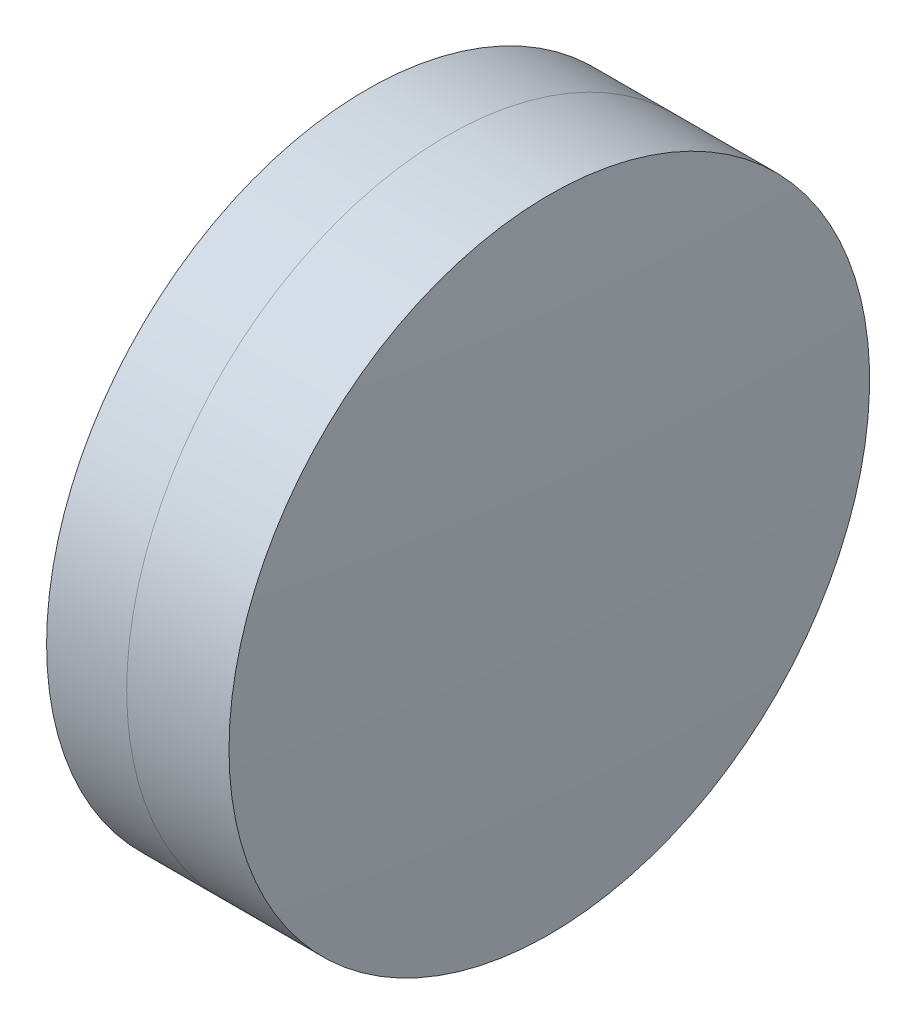
ISO-10303-21;
HEADER;
FILE_DESCRIPTION(('STEP AP214'),'2;1');
FILE_NAME('part.step','',(''),(''),'','','');
FILE_SCHEMA(('AUTOMOTIVE_DESIGN { 1 0 10303 214 1 1 1 1 }'));
ENDSEC;
DATA;
#1=APPLICATION_CONTEXT('core data for automotive mechanical design processes');
#2=APPLICATION_PROTOCOL_DEFINITION('international standard','automotive_design',2000,#1);
#3=PRODUCT_CONTEXT('',#1,'mechanical');
#4=PRODUCT('Part','Part','',(#3));
#5=PRODUCT_RELATED_PRODUCT_CATEGORY('part','',(#4));
#6=PRODUCT_DEFINITION_FORMATION('','',#4);
#7=PRODUCT_DEFINITION_CONTEXT('part definition',#1,'design');
#8=PRODUCT_DEFINITION('design','',#6,#7);
#9=PRODUCT_DEFINITION_SHAPE('','',#8);
#10=(LENGTH_UNIT() NAMED_UNIT(*) SI_UNIT(.MILLI.,.METRE.));
#11=(NAMED_UNIT(*) PLANE_ANGLE_UNIT() SI_UNIT($,.RADIAN.));
#12=(NAMED_UNIT(*) SI_UNIT($,.STERADIAN.) SOLID_ANGLE_UNIT());
#13=UNCERTAINTY_MEASURE_WITH_UNIT(LENGTH_MEASURE(1.E-05),#10,'distance_accuracy_value','');
#14=(GEOMETRIC_REPRESENTATION_CONTEXT(3) GLOBAL_UNCERTAINTY_ASSIGNED_CONTEXT((#13)) GLOBAL_UNIT_ASSIGNED_CONTEXT((#10,
#11,#12)) REPRESENTATION_CONTEXT('',''));
#15=CARTESIAN_POINT('',(0.,0.,0.));
#16=DIRECTION('',(0.,0.,1.));
#17=DIRECTION('',(1.,0.,0.));
#18=AXIS2_PLACEMENT_3D('',#15,#16,#17);
#19=CARTESIAN_POINT('',(-3.99472938404635,0.,0.));
#20=DIRECTION('',(-1.,0.,0.));
#21=DIRECTION('',(0.,0.,1.));
#22=AXIS2_PLACEMENT_3D('',#19,#20,#21);
#23=SPHERICAL_SURFACE('',#22,40.411);
#24=CARTESIAN_POINT('',(35.6164927758416,0.,0.));
#25=DIRECTION('',(-1.,0.,0.));
#26=DIRECTION('',(0.,0.,1.));
#27=AXIS2_PLACEMENT_3D('',#24,#25,#26);
#28=CIRCLE('',#27,8.00000000000001);
#29=CARTESIAN_POINT('',(35.6164927758416,0.,8.00000000000001));
#30=VERTEX_POINT('',#29);
#31=EDGE_CURVE('E11',#30,#30,#28,.T.);
#32=ORIENTED_EDGE('',*,*,#31,.T.);
#33=EDGE_LOOP('',(#32));
#34=FACE_BOUND('',#33,.T.);
#35=ADVANCED_FACE('F45',(#34),#23,.F.);
#36=CARTESIAN_POINT('',(-0.551919992657797,0.,0.));
#37=DIRECTION('',(-1.,0.,0.));
#38=DIRECTION('',(0.,0.,1.));
#39=AXIS2_PLACEMENT_3D('',#36,#37,#38);
#40=CYLINDRICAL_SURFACE('',#39,8.00000000000001);
#41=CARTESIAN_POINT('',(38.1709063103237,0.,0.));
#42=DIRECTION('',(-1.,0.,0.));
#43=DIRECTION('',(0.,0.,1.));
#44=AXIS2_PLACEMENT_3D('',#41,#42,#43);
#45=CIRCLE('',#44,8.00000000000001);
#46=CARTESIAN_POINT('',(38.1709063103237,0.,8.00000000000001));
#47=VERTEX_POINT('',#46);
#48=EDGE_CURVE('E51',#47,#47,#45,.T.);
#49=ORIENTED_EDGE('',*,*,#48,.T.);
#50=EDGE_LOOP('',(#49));
#51=FACE_BOUND('',#50,.T.);
#52=ORIENTED_EDGE('',*,*,#31,.F.);
#53=EDGE_LOOP('',(#52));
#54=FACE_BOUND('',#53,.T.);
#55=ADVANCED_FACE('F57',(#51,#54),#40,.T.);
#56=CARTESIAN_POINT('',(-92.1247293840463,0.,0.));
#57=DIRECTION('',(-1.,0.,0.));
#58=DIRECTION('',(0.,0.,1.));
#59=AXIS2_PLACEMENT_3D('',#56,#57,#58);
#60=SPHERICAL_SURFACE('',#59,130.541);
#61=ORIENTED_EDGE('',*,*,#48,.F.);
#62=EDGE_LOOP('',(#61));
#63=FACE_BOUND('',#62,.T.);
#64=ADVANCED_FACE('F60',(#63),#60,.T.);
#65=CLOSED_SHELL('',(#35,#55,#64));
#66=MANIFOLD_SOLID_BREP('B2',#65);
#67=CARTESIAN_POINT('',(95.0502706159536,0.,0.));
#68=DIRECTION('',(-1.,0.,0.));
#69=DIRECTION('',(0.,0.,-1.));
#70=AXIS2_PLACEMENT_3D('',#67,#68,#69);
#71=SPHERICAL_SURFACE('',#70,61.954);
#72=CARTESIAN_POINT('',(33.6149540952422,0.,0.));
#73=DIRECTION('',(-1.,0.,0.));
#74=DIRECTION('',(0.,0.,1.));
#75=AXIS2_PLACEMENT_3D('',#72,#73,#74);
#76=CIRCLE('',#75,8.);
#77=CARTESIAN_POINT('',(33.6149540952422,0.,8.));
#78=VERTEX_POINT('',#77);
#79=EDGE_CURVE('E44',#78,#78,#76,.T.);
#80=ORIENTED_EDGE('',*,*,#79,.T.);
#81=EDGE_LOOP('',(#80));
#82=FACE_BOUND('',#81,.T.);
#83=ADVANCED_FACE('F86',(#82),#71,.T.);
#84=CARTESIAN_POINT('',(-9.70261217833668,0.,0.));
#85=DIRECTION('',(-1.,0.,0.));
#86=DIRECTION('',(0.,0.,1.));
#87=AXIS2_PLACEMENT_3D('',#84,#85,#86);
#88=CYLINDRICAL_SURFACE('',#87,8.);
#89=CARTESIAN_POINT('',(35.6164927758416,0.,0.));
#90=DIRECTION('',(-1.,0.,0.));
#91=DIRECTION('',(0.,0.,1.));
#92=AXIS2_PLACEMENT_3D('',#89,#90,#91);
#93=CIRCLE('',#92,8.);
#94=CARTESIAN_POINT('',(35.6164927758416,0.,8.));
#95=VERTEX_POINT('',#94);
#96=EDGE_CURVE('E92',#95,#95,#93,.T.);
#97=ORIENTED_EDGE('',*,*,#96,.T.);
#98=EDGE_LOOP('',(#97));
#99=FACE_BOUND('',#98,.T.);
#100=ORIENTED_EDGE('',*,*,#79,.F.);
#101=EDGE_LOOP('',(#100));
#102=FACE_BOUND('',#101,.T.);
#103=ADVANCED_FACE('F98',(#99,#102),#88,.T.);
#104=CARTESIAN_POINT('',(-3.99472938404635,0.,0.));
#105=DIRECTION('',(-1.,0.,0.));
#106=DIRECTION('',(0.,0.,1.));
#107=AXIS2_PLACEMENT_3D('',#104,#105,#106);
#108=SPHERICAL_SURFACE('',#107,40.411);
#109=ORIENTED_EDGE('',*,*,#96,.F.);
#110=EDGE_LOOP('',(#109));
#111=FACE_BOUND('',#110,.T.);
#112=ADVANCED_FACE('F101',(#111),#108,.T.);
#113=CLOSED_SHELL('',(#83,#103,#112));
#114=MANIFOLD_SOLID_BREP('B6',#113);
#115=ADVANCED_BREP_SHAPE_REPRESENTATION('',(#18,#66,#114),#14);
#116=SHAPE_DEFINITION_REPRESENTATION(#9,#115);
ENDSEC;
END-ISO-10303-21;
